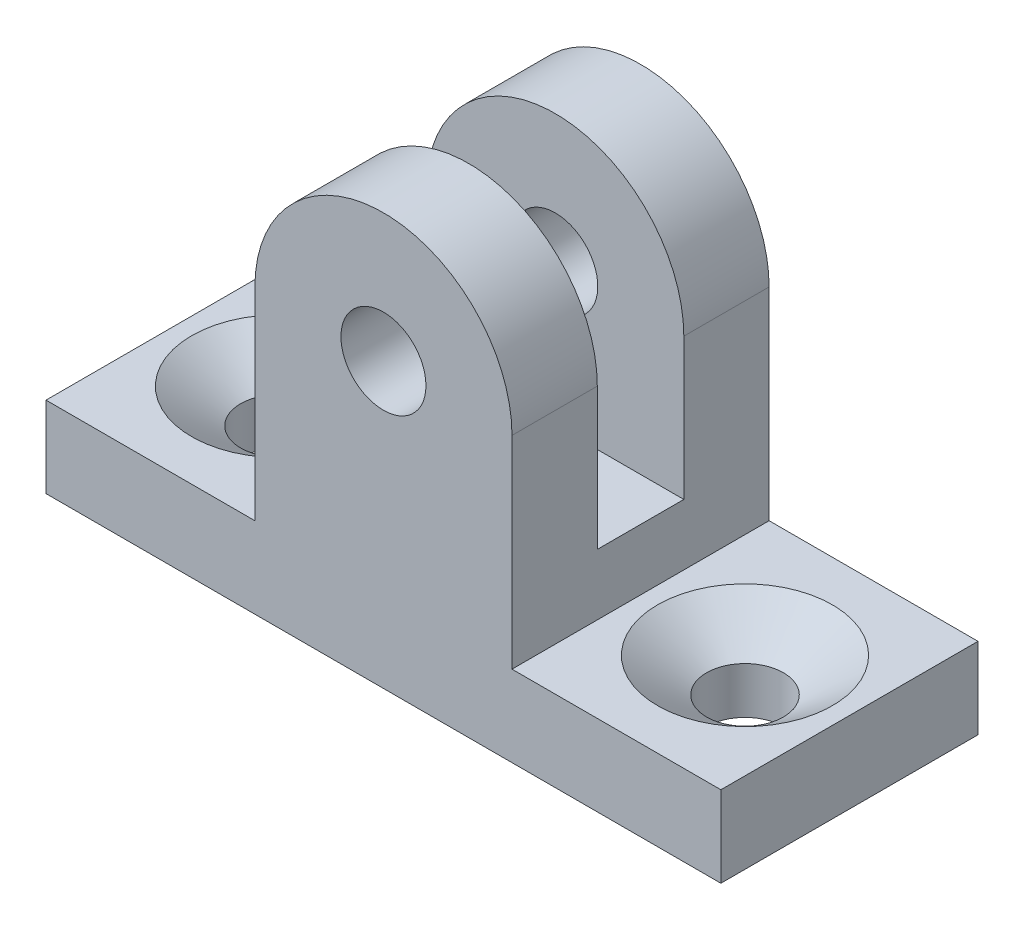
ISO-10303-21;
HEADER;
FILE_DESCRIPTION(('STEP AP214'),'2;1');
FILE_NAME('part.step','',(''),(''),'','','');
FILE_SCHEMA(('AUTOMOTIVE_DESIGN { 1 0 10303 214 1 1 1 1 }'));
ENDSEC;
DATA;
#1=APPLICATION_CONTEXT('core data for automotive mechanical design processes');
#2=APPLICATION_PROTOCOL_DEFINITION('international standard','automotive_design',2000,#1);
#3=PRODUCT_CONTEXT('',#1,'mechanical');
#4=PRODUCT('Part','Part','',(#3));
#5=PRODUCT_RELATED_PRODUCT_CATEGORY('part','',(#4));
#6=PRODUCT_DEFINITION_FORMATION('','',#4);
#7=PRODUCT_DEFINITION_CONTEXT('part definition',#1,'design');
#8=PRODUCT_DEFINITION('design','',#6,#7);
#9=PRODUCT_DEFINITION_SHAPE('','',#8);
#10=(LENGTH_UNIT() NAMED_UNIT(*) SI_UNIT(.MILLI.,.METRE.));
#11=(NAMED_UNIT(*) PLANE_ANGLE_UNIT() SI_UNIT($,.RADIAN.));
#12=(NAMED_UNIT(*) SI_UNIT($,.STERADIAN.) SOLID_ANGLE_UNIT());
#13=UNCERTAINTY_MEASURE_WITH_UNIT(LENGTH_MEASURE(1.E-05),#10,'distance_accuracy_value','');
#14=(GEOMETRIC_REPRESENTATION_CONTEXT(3) GLOBAL_UNCERTAINTY_ASSIGNED_CONTEXT((#13)) GLOBAL_UNIT_ASSIGNED_CONTEXT((#10,
#11,#12)) REPRESENTATION_CONTEXT('',''));
#15=CARTESIAN_POINT('',(0.,0.,0.));
#16=DIRECTION('',(0.,0.,1.));
#17=DIRECTION('',(1.,0.,0.));
#18=AXIS2_PLACEMENT_3D('',#15,#16,#17);
#19=CARTESIAN_POINT('',(0.,10.5,9.525));
#20=DIRECTION('',(0.,0.,-1.));
#21=DIRECTION('',(-1.,0.,0.));
#22=AXIS2_PLACEMENT_3D('',#19,#20,#21);
#23=CYLINDRICAL_SURFACE('',#22,4.7625);
#24=DIRECTION('',(0.,0.,-1.));
#25=VECTOR('',#24,1.);
#26=CARTESIAN_POINT('',(4.7625,10.5,9.525));
#27=LINE('',#26,#25);
#28=CARTESIAN_POINT('',(4.7625,10.5,9.525));
#29=VERTEX_POINT('',#28);
#30=CARTESIAN_POINT('',(4.7625,10.5,6.365));
#31=VERTEX_POINT('',#30);
#32=EDGE_CURVE('E41',#29,#31,#27,.T.);
#33=ORIENTED_EDGE('',*,*,#32,.T.);
#34=CARTESIAN_POINT('',(0.,10.5,6.365));
#35=DIRECTION('',(0.,0.,1.));
#36=DIRECTION('',(0.,-1.,0.));
#37=AXIS2_PLACEMENT_3D('',#34,#35,#36);
#38=CIRCLE('',#37,4.7625);
#39=CARTESIAN_POINT('',(-4.76249999999999,10.5,6.365));
#40=VERTEX_POINT('',#39);
#41=EDGE_CURVE('E181',#31,#40,#38,.T.);
#42=ORIENTED_EDGE('',*,*,#41,.T.);
#43=DIRECTION('',(0.,0.,-1.));
#44=VECTOR('',#43,1.);
#45=CARTESIAN_POINT('',(-4.7625,10.5,9.525));
#46=LINE('',#45,#44);
#47=CARTESIAN_POINT('',(-4.7625,10.5,9.525));
#48=VERTEX_POINT('',#47);
#49=EDGE_CURVE('E169',#48,#40,#46,.T.);
#50=ORIENTED_EDGE('',*,*,#49,.F.);
#51=CARTESIAN_POINT('',(0.,10.5,9.525));
#52=DIRECTION('',(0.,0.,1.));
#53=DIRECTION('',(-1.,0.,0.));
#54=AXIS2_PLACEMENT_3D('',#51,#52,#53);
#55=CIRCLE('',#54,4.7625);
#56=EDGE_CURVE('E232',#29,#48,#55,.T.);
#57=ORIENTED_EDGE('',*,*,#56,.F.);
#58=EDGE_LOOP('',(#33,#42,#50,#57));
#59=FACE_BOUND('',#58,.T.);
#60=ADVANCED_FACE('F32',(#59),#23,.T.);
#61=CARTESIAN_POINT('',(0.,10.5,9.525));
#62=DIRECTION('',(0.,0.,-1.));
#63=DIRECTION('',(-1.,0.,0.));
#64=AXIS2_PLACEMENT_3D('',#61,#62,#63);
#65=CYLINDRICAL_SURFACE('',#64,1.575);
#66=CARTESIAN_POINT('',(0.,10.5,6.365));
#67=DIRECTION('',(0.,0.,1.));
#68=DIRECTION('',(0.,-1.,0.));
#69=AXIS2_PLACEMENT_3D('',#66,#67,#68);
#70=CIRCLE('',#69,1.575);
#71=CARTESIAN_POINT('',(0.,8.925,6.365));
#72=VERTEX_POINT('',#71);
#73=EDGE_CURVE('E179',#72,#72,#70,.T.);
#74=ORIENTED_EDGE('',*,*,#73,.F.);
#75=EDGE_LOOP('',(#74));
#76=FACE_BOUND('',#75,.T.);
#77=CARTESIAN_POINT('',(0.,10.5,9.525));
#78=DIRECTION('',(0.,0.,1.));
#79=DIRECTION('',(1.,0.,0.));
#80=AXIS2_PLACEMENT_3D('',#77,#78,#79);
#81=CIRCLE('',#80,1.575);
#82=CARTESIAN_POINT('',(1.575,10.5,9.525));
#83=VERTEX_POINT('',#82);
#84=EDGE_CURVE('E147',#83,#83,#81,.T.);
#85=ORIENTED_EDGE('',*,*,#84,.T.);
#86=EDGE_LOOP('',(#85));
#87=FACE_BOUND('',#86,.T.);
#88=ADVANCED_FACE('F291',(#76,#87),#65,.F.);
#89=CARTESIAN_POINT('',(0.,10.5,9.525));
#90=DIRECTION('',(0.,0.,-1.));
#91=DIRECTION('',(-1.,0.,0.));
#92=AXIS2_PLACEMENT_3D('',#89,#90,#91);
#93=PLANE('',#92);
#94=DIRECTION('',(-1.,0.,0.));
#95=VECTOR('',#94,1.);
#96=CARTESIAN_POINT('',(4.7625,3.,9.525));
#97=LINE('',#96,#95);
#98=CARTESIAN_POINT('',(12.5,3.,9.525));
#99=VERTEX_POINT('',#98);
#100=CARTESIAN_POINT('',(4.7625,3.,9.525));
#101=VERTEX_POINT('',#100);
#102=EDGE_CURVE('E161',#99,#101,#97,.T.);
#103=ORIENTED_EDGE('',*,*,#102,.T.);
#104=DIRECTION('',(0.,1.,0.));
#105=VECTOR('',#104,1.);
#106=CARTESIAN_POINT('',(4.7625,10.5,9.525));
#107=LINE('',#106,#105);
#108=EDGE_CURVE('E99',#101,#29,#107,.T.);
#109=ORIENTED_EDGE('',*,*,#108,.T.);
#110=ORIENTED_EDGE('',*,*,#56,.T.);
#111=DIRECTION('',(0.,-1.,0.));
#112=VECTOR('',#111,1.);
#113=CARTESIAN_POINT('',(-4.7625,10.5,9.525));
#114=LINE('',#113,#112);
#115=CARTESIAN_POINT('',(-4.76249999999999,3.,9.525));
#116=VERTEX_POINT('',#115);
#117=EDGE_CURVE('E234',#48,#116,#114,.T.);
#118=ORIENTED_EDGE('',*,*,#117,.T.);
#119=DIRECTION('',(-1.,0.,0.));
#120=VECTOR('',#119,1.);
#121=CARTESIAN_POINT('',(-4.76249999999999,3.,9.525));
#122=LINE('',#121,#120);
#123=CARTESIAN_POINT('',(-12.5,3.,9.525));
#124=VERTEX_POINT('',#123);
#125=EDGE_CURVE('E122',#116,#124,#122,.T.);
#126=ORIENTED_EDGE('',*,*,#125,.T.);
#127=DIRECTION('',(0.,-1.,0.));
#128=VECTOR('',#127,1.);
#129=CARTESIAN_POINT('',(-12.5,3.,9.525));
#130=LINE('',#129,#128);
#131=CARTESIAN_POINT('',(-12.5,0.,9.525));
#132=VERTEX_POINT('',#131);
#133=EDGE_CURVE('E114',#124,#132,#130,.T.);
#134=ORIENTED_EDGE('',*,*,#133,.T.);
#135=DIRECTION('',(1.,0.,0.));
#136=VECTOR('',#135,1.);
#137=CARTESIAN_POINT('',(-12.5,0.,9.525));
#138=LINE('',#137,#136);
#139=CARTESIAN_POINT('',(12.5,0.,9.525));
#140=VERTEX_POINT('',#139);
#141=EDGE_CURVE('E119',#132,#140,#138,.T.);
#142=ORIENTED_EDGE('',*,*,#141,.T.);
#143=DIRECTION('',(0.,1.,0.));
#144=VECTOR('',#143,1.);
#145=CARTESIAN_POINT('',(12.5,3.,9.525));
#146=LINE('',#145,#144);
#147=EDGE_CURVE('E58',#140,#99,#146,.T.);
#148=ORIENTED_EDGE('',*,*,#147,.T.);
#149=EDGE_LOOP('',(#103,#109,#110,#118,#126,#134,#142,#148));
#150=FACE_BOUND('',#149,.T.);
#151=ORIENTED_EDGE('',*,*,#84,.F.);
#152=EDGE_LOOP('',(#151));
#153=FACE_BOUND('',#152,.T.);
#154=ADVANCED_FACE('F116',(#150,#153),#93,.F.);
#155=CARTESIAN_POINT('',(0.,10.5,0.));
#156=DIRECTION('',(0.,0.,-1.));
#157=DIRECTION('',(-1.,0.,0.));
#158=AXIS2_PLACEMENT_3D('',#155,#156,#157);
#159=PLANE('',#158);
#160=DIRECTION('',(-1.,0.,0.));
#161=VECTOR('',#160,1.);
#162=CARTESIAN_POINT('',(4.7625,3.,0.));
#163=LINE('',#162,#161);
#164=CARTESIAN_POINT('',(12.5,3.,0.));
#165=VERTEX_POINT('',#164);
#166=CARTESIAN_POINT('',(4.7625,3.,0.));
#167=VERTEX_POINT('',#166);
#168=EDGE_CURVE('E143',#165,#167,#163,.T.);
#169=ORIENTED_EDGE('',*,*,#168,.F.);
#170=DIRECTION('',(0.,1.,0.));
#171=VECTOR('',#170,1.);
#172=CARTESIAN_POINT('',(12.5,3.,0.));
#173=LINE('',#172,#171);
#174=CARTESIAN_POINT('',(12.5,0.,0.));
#175=VERTEX_POINT('',#174);
#176=EDGE_CURVE('E91',#175,#165,#173,.T.);
#177=ORIENTED_EDGE('',*,*,#176,.F.);
#178=DIRECTION('',(1.,0.,0.));
#179=VECTOR('',#178,1.);
#180=CARTESIAN_POINT('',(-12.5,0.,0.));
#181=LINE('',#180,#179);
#182=CARTESIAN_POINT('',(-12.5,0.,0.));
#183=VERTEX_POINT('',#182);
#184=EDGE_CURVE('E158',#183,#175,#181,.T.);
#185=ORIENTED_EDGE('',*,*,#184,.F.);
#186=DIRECTION('',(0.,-1.,0.));
#187=VECTOR('',#186,1.);
#188=CARTESIAN_POINT('',(-12.5,3.,0.));
#189=LINE('',#188,#187);
#190=CARTESIAN_POINT('',(-12.5,3.,0.));
#191=VERTEX_POINT('',#190);
#192=EDGE_CURVE('E131',#191,#183,#189,.T.);
#193=ORIENTED_EDGE('',*,*,#192,.F.);
#194=DIRECTION('',(-1.,0.,0.));
#195=VECTOR('',#194,1.);
#196=CARTESIAN_POINT('',(-4.76249999999999,3.,0.));
#197=LINE('',#196,#195);
#198=CARTESIAN_POINT('',(-4.76249999999999,3.,0.));
#199=VERTEX_POINT('',#198);
#200=EDGE_CURVE('E155',#199,#191,#197,.T.);
#201=ORIENTED_EDGE('',*,*,#200,.F.);
#202=DIRECTION('',(0.,-1.,0.));
#203=VECTOR('',#202,1.);
#204=CARTESIAN_POINT('',(-4.7625,10.5,0.));
#205=LINE('',#204,#203);
#206=CARTESIAN_POINT('',(-4.7625,10.5,0.));
#207=VERTEX_POINT('',#206);
#208=EDGE_CURVE('E153',#207,#199,#205,.T.);
#209=ORIENTED_EDGE('',*,*,#208,.F.);
#210=CARTESIAN_POINT('',(0.,10.5,0.));
#211=DIRECTION('',(0.,0.,1.));
#212=DIRECTION('',(-1.,0.,0.));
#213=AXIS2_PLACEMENT_3D('',#210,#211,#212);
#214=CIRCLE('',#213,4.7625);
#215=CARTESIAN_POINT('',(4.7625,10.5,0.));
#216=VERTEX_POINT('',#215);
#217=EDGE_CURVE('E150',#216,#207,#214,.T.);
#218=ORIENTED_EDGE('',*,*,#217,.F.);
#219=DIRECTION('',(0.,1.,0.));
#220=VECTOR('',#219,1.);
#221=CARTESIAN_POINT('',(4.7625,10.5,0.));
#222=LINE('',#221,#220);
#223=EDGE_CURVE('E146',#167,#216,#222,.T.);
#224=ORIENTED_EDGE('',*,*,#223,.F.);
#225=EDGE_LOOP('',(#169,#177,#185,#193,#201,#209,#218,#224));
#226=FACE_BOUND('',#225,.T.);
#227=CARTESIAN_POINT('',(0.,10.5,0.));
#228=DIRECTION('',(0.,0.,1.));
#229=DIRECTION('',(1.,0.,0.));
#230=AXIS2_PLACEMENT_3D('',#227,#228,#229);
#231=CIRCLE('',#230,1.575);
#232=CARTESIAN_POINT('',(1.575,10.5,0.));
#233=VERTEX_POINT('',#232);
#234=EDGE_CURVE('E225',#233,#233,#231,.T.);
#235=ORIENTED_EDGE('',*,*,#234,.T.);
#236=EDGE_LOOP('',(#235));
#237=FACE_BOUND('',#236,.T.);
#238=ADVANCED_FACE('F247',(#226,#237),#159,.T.);
#239=CARTESIAN_POINT('',(4.7625,3.,9.525));
#240=DIRECTION('',(0.,-1.,0.));
#241=DIRECTION('',(1.,0.,0.));
#242=AXIS2_PLACEMENT_3D('',#239,#240,#241);
#243=PLANE('',#242);
#244=CARTESIAN_POINT('',(8.63125,3.,4.7625));
#245=DIRECTION('',(0.,1.,0.));
#246=DIRECTION('',(-1.,0.,0.));
#247=AXIS2_PLACEMENT_3D('',#244,#245,#246);
#248=CIRCLE('',#247,3.2385);
#249=CARTESIAN_POINT('',(5.39275,3.,4.7625));
#250=VERTEX_POINT('',#249);
#251=EDGE_CURVE('E185',#250,#250,#248,.T.);
#252=ORIENTED_EDGE('',*,*,#251,.F.);
#253=EDGE_LOOP('',(#252));
#254=FACE_BOUND('',#253,.T.);
#255=ORIENTED_EDGE('',*,*,#168,.T.);
#256=DIRECTION('',(0.,0.,-1.));
#257=VECTOR('',#256,1.);
#258=CARTESIAN_POINT('',(4.7625,3.,9.525));
#259=LINE('',#258,#257);
#260=EDGE_CURVE('E11',#101,#167,#259,.T.);
#261=ORIENTED_EDGE('',*,*,#260,.F.);
#262=ORIENTED_EDGE('',*,*,#102,.F.);
#263=DIRECTION('',(0.,0.,-1.));
#264=VECTOR('',#263,1.);
#265=CARTESIAN_POINT('',(12.5,3.,9.525));
#266=LINE('',#265,#264);
#267=EDGE_CURVE('E139',#99,#165,#266,.T.);
#268=ORIENTED_EDGE('',*,*,#267,.T.);
#269=EDGE_LOOP('',(#255,#261,#262,#268));
#270=FACE_BOUND('',#269,.T.);
#271=ADVANCED_FACE('F34',(#254,#270),#243,.F.);
#272=CARTESIAN_POINT('',(4.7625,10.5,9.525));
#273=DIRECTION('',(-1.,0.,0.));
#274=DIRECTION('',(0.,-1.,0.));
#275=AXIS2_PLACEMENT_3D('',#272,#273,#274);
#276=PLANE('',#275);
#277=DIRECTION('',(0.,0.,-1.));
#278=VECTOR('',#277,1.);
#279=CARTESIAN_POINT('',(4.7625,5.2625,6.365));
#280=LINE('',#279,#278);
#281=CARTESIAN_POINT('',(4.7625,5.2625,6.365));
#282=VERTEX_POINT('',#281);
#283=CARTESIAN_POINT('',(4.7625,5.2625,3.16));
#284=VERTEX_POINT('',#283);
#285=EDGE_CURVE('E202',#282,#284,#280,.T.);
#286=ORIENTED_EDGE('',*,*,#285,.F.);
#287=DIRECTION('',(0.,-1.,0.));
#288=VECTOR('',#287,1.);
#289=CARTESIAN_POINT('',(4.7625,15.2625,6.365));
#290=LINE('',#289,#288);
#291=EDGE_CURVE('E205',#31,#282,#290,.T.);
#292=ORIENTED_EDGE('',*,*,#291,.F.);
#293=ORIENTED_EDGE('',*,*,#32,.F.);
#294=ORIENTED_EDGE('',*,*,#108,.F.);
#295=ORIENTED_EDGE('',*,*,#260,.T.);
#296=ORIENTED_EDGE('',*,*,#223,.T.);
#297=CARTESIAN_POINT('',(4.7625,10.5,3.16));
#298=VERTEX_POINT('',#297);
#299=EDGE_CURVE('E172',#298,#216,#27,.T.);
#300=ORIENTED_EDGE('',*,*,#299,.F.);
#301=DIRECTION('',(0.,1.,0.));
#302=VECTOR('',#301,1.);
#303=CARTESIAN_POINT('',(4.7625,5.2625,3.16));
#304=LINE('',#303,#302);
#305=EDGE_CURVE('E178',#284,#298,#304,.T.);
#306=ORIENTED_EDGE('',*,*,#305,.F.);
#307=EDGE_LOOP('',(#286,#292,#293,#294,#295,#296,#300,#306));
#308=FACE_BOUND('',#307,.T.);
#309=ADVANCED_FACE('F255',(#308),#276,.F.);
#310=CARTESIAN_POINT('',(0.,10.5,3.16));
#311=DIRECTION('',(0.,0.,-1.));
#312=DIRECTION('',(0.,1.,0.));
#313=AXIS2_PLACEMENT_3D('',#310,#311,#312);
#314=CIRCLE('',#313,4.7625);
#315=CARTESIAN_POINT('',(-4.7625,10.5,3.16));
#316=VERTEX_POINT('',#315);
#317=EDGE_CURVE('E49',#316,#298,#314,.T.);
#318=ORIENTED_EDGE('',*,*,#317,.T.);
#319=ORIENTED_EDGE('',*,*,#299,.T.);
#320=ORIENTED_EDGE('',*,*,#217,.T.);
#321=EDGE_CURVE('E168',#316,#207,#46,.T.);
#322=ORIENTED_EDGE('',*,*,#321,.F.);
#323=EDGE_LOOP('',(#318,#319,#320,#322));
#324=FACE_BOUND('',#323,.T.);
#325=ADVANCED_FACE('F282',(#324),#23,.T.);
#326=CARTESIAN_POINT('',(-4.7625,10.5,9.525));
#327=DIRECTION('',(1.,0.,0.));
#328=DIRECTION('',(0.,1.,0.));
#329=AXIS2_PLACEMENT_3D('',#326,#327,#328);
#330=PLANE('',#329);
#331=ORIENTED_EDGE('',*,*,#49,.T.);
#332=DIRECTION('',(0.,1.,0.));
#333=VECTOR('',#332,1.);
#334=CARTESIAN_POINT('',(-4.76249999999999,15.2625,6.365));
#335=LINE('',#334,#333);
#336=CARTESIAN_POINT('',(-4.76249999999999,5.2625,6.365));
#337=VERTEX_POINT('',#336);
#338=EDGE_CURVE('E213',#337,#40,#335,.T.);
#339=ORIENTED_EDGE('',*,*,#338,.F.);
#340=DIRECTION('',(0.,0.,1.));
#341=VECTOR('',#340,1.);
#342=CARTESIAN_POINT('',(-4.76249999999999,5.2625,6.365));
#343=LINE('',#342,#341);
#344=CARTESIAN_POINT('',(-4.76249999999999,5.2625,3.16));
#345=VERTEX_POINT('',#344);
#346=EDGE_CURVE('E210',#345,#337,#343,.T.);
#347=ORIENTED_EDGE('',*,*,#346,.F.);
#348=DIRECTION('',(0.,-1.,0.));
#349=VECTOR('',#348,1.);
#350=CARTESIAN_POINT('',(-4.76249999999999,5.2625,3.16));
#351=LINE('',#350,#349);
#352=EDGE_CURVE('E201',#316,#345,#351,.T.);
#353=ORIENTED_EDGE('',*,*,#352,.F.);
#354=ORIENTED_EDGE('',*,*,#321,.T.);
#355=ORIENTED_EDGE('',*,*,#208,.T.);
#356=DIRECTION('',(0.,0.,-1.));
#357=VECTOR('',#356,1.);
#358=CARTESIAN_POINT('',(-4.76249999999999,3.,9.525));
#359=LINE('',#358,#357);
#360=EDGE_CURVE('E165',#116,#199,#359,.T.);
#361=ORIENTED_EDGE('',*,*,#360,.F.);
#362=ORIENTED_EDGE('',*,*,#117,.F.);
#363=EDGE_LOOP('',(#331,#339,#347,#353,#354,#355,#361,#362));
#364=FACE_BOUND('',#363,.T.);
#365=ADVANCED_FACE('F240',(#364),#330,.F.);
#366=CARTESIAN_POINT('',(-4.76249999999999,3.,9.525));
#367=DIRECTION('',(0.,-1.,0.));
#368=DIRECTION('',(1.,0.,0.));
#369=AXIS2_PLACEMENT_3D('',#366,#367,#368);
#370=PLANE('',#369);
#371=CARTESIAN_POINT('',(-8.63125,3.,4.76250000000001));
#372=DIRECTION('',(0.,1.,0.));
#373=DIRECTION('',(-1.,0.,0.));
#374=AXIS2_PLACEMENT_3D('',#371,#372,#373);
#375=CIRCLE('',#374,3.2385);
#376=CARTESIAN_POINT('',(-11.86975,3.,4.76250000000001));
#377=VERTEX_POINT('',#376);
#378=EDGE_CURVE('E196',#377,#377,#375,.T.);
#379=ORIENTED_EDGE('',*,*,#378,.F.);
#380=EDGE_LOOP('',(#379));
#381=FACE_BOUND('',#380,.T.);
#382=ORIENTED_EDGE('',*,*,#200,.T.);
#383=DIRECTION('',(0.,0.,-1.));
#384=VECTOR('',#383,1.);
#385=CARTESIAN_POINT('',(-12.5,3.,9.525));
#386=LINE('',#385,#384);
#387=EDGE_CURVE('E134',#124,#191,#386,.T.);
#388=ORIENTED_EDGE('',*,*,#387,.F.);
#389=ORIENTED_EDGE('',*,*,#125,.F.);
#390=ORIENTED_EDGE('',*,*,#360,.T.);
#391=EDGE_LOOP('',(#382,#388,#389,#390));
#392=FACE_BOUND('',#391,.T.);
#393=ADVANCED_FACE('F244',(#381,#392),#370,.F.);
#394=CARTESIAN_POINT('',(-12.5,3.,9.525));
#395=DIRECTION('',(1.,0.,0.));
#396=DIRECTION('',(0.,0.,-1.));
#397=AXIS2_PLACEMENT_3D('',#394,#395,#396);
#398=PLANE('',#397);
#399=ORIENTED_EDGE('',*,*,#192,.T.);
#400=DIRECTION('',(0.,0.,-1.));
#401=VECTOR('',#400,1.);
#402=CARTESIAN_POINT('',(-12.5,0.,9.525));
#403=LINE('',#402,#401);
#404=EDGE_CURVE('E128',#132,#183,#403,.T.);
#405=ORIENTED_EDGE('',*,*,#404,.F.);
#406=ORIENTED_EDGE('',*,*,#133,.F.);
#407=ORIENTED_EDGE('',*,*,#387,.T.);
#408=EDGE_LOOP('',(#399,#405,#406,#407));
#409=FACE_BOUND('',#408,.T.);
#410=ADVANCED_FACE('F129',(#409),#398,.F.);
#411=CARTESIAN_POINT('',(-12.5,0.,9.525));
#412=DIRECTION('',(0.,1.,0.));
#413=DIRECTION('',(-1.,0.,0.));
#414=AXIS2_PLACEMENT_3D('',#411,#412,#413);
#415=PLANE('',#414);
#416=CARTESIAN_POINT('',(-8.63125,0.,4.76250000000001));
#417=DIRECTION('',(0.,1.,0.));
#418=DIRECTION('',(-1.,0.,0.));
#419=AXIS2_PLACEMENT_3D('',#416,#417,#418);
#420=CIRCLE('',#419,1.4224);
#421=CARTESIAN_POINT('',(-10.05365,0.,4.76250000000001));
#422=VERTEX_POINT('',#421);
#423=EDGE_CURVE('E184',#422,#422,#420,.F.);
#424=ORIENTED_EDGE('',*,*,#423,.F.);
#425=EDGE_LOOP('',(#424));
#426=FACE_BOUND('',#425,.T.);
#427=CARTESIAN_POINT('',(8.63125,0.,4.7625));
#428=DIRECTION('',(0.,1.,0.));
#429=DIRECTION('',(-1.,0.,0.));
#430=AXIS2_PLACEMENT_3D('',#427,#428,#429);
#431=CIRCLE('',#430,1.4224);
#432=CARTESIAN_POINT('',(7.20885,0.,4.7625));
#433=VERTEX_POINT('',#432);
#434=EDGE_CURVE('E189',#433,#433,#431,.F.);
#435=ORIENTED_EDGE('',*,*,#434,.F.);
#436=EDGE_LOOP('',(#435));
#437=FACE_BOUND('',#436,.T.);
#438=ORIENTED_EDGE('',*,*,#184,.T.);
#439=DIRECTION('',(0.,0.,-1.));
#440=VECTOR('',#439,1.);
#441=CARTESIAN_POINT('',(12.5,0.,9.525));
#442=LINE('',#441,#440);
#443=EDGE_CURVE('E135',#140,#175,#442,.T.);
#444=ORIENTED_EDGE('',*,*,#443,.F.);
#445=ORIENTED_EDGE('',*,*,#141,.F.);
#446=ORIENTED_EDGE('',*,*,#404,.T.);
#447=EDGE_LOOP('',(#438,#444,#445,#446));
#448=FACE_BOUND('',#447,.T.);
#449=ADVANCED_FACE('F137',(#426,#437,#448),#415,.F.);
#450=CARTESIAN_POINT('',(12.5,3.,9.525));
#451=DIRECTION('',(-1.,0.,0.));
#452=DIRECTION('',(0.,-1.,0.));
#453=AXIS2_PLACEMENT_3D('',#450,#451,#452);
#454=PLANE('',#453);
#455=ORIENTED_EDGE('',*,*,#176,.T.);
#456=ORIENTED_EDGE('',*,*,#267,.F.);
#457=ORIENTED_EDGE('',*,*,#147,.F.);
#458=ORIENTED_EDGE('',*,*,#443,.T.);
#459=EDGE_LOOP('',(#455,#456,#457,#458));
#460=FACE_BOUND('',#459,.T.);
#461=ADVANCED_FACE('F249',(#460),#454,.F.);
#462=CARTESIAN_POINT('',(0.,10.5,3.16));
#463=DIRECTION('',(0.,0.,-1.));
#464=DIRECTION('',(0.,1.,0.));
#465=AXIS2_PLACEMENT_3D('',#462,#463,#464);
#466=CIRCLE('',#465,1.575);
#467=CARTESIAN_POINT('',(0.,12.075,3.16));
#468=VERTEX_POINT('',#467);
#469=EDGE_CURVE('E175',#468,#468,#466,.T.);
#470=ORIENTED_EDGE('',*,*,#469,.F.);
#471=EDGE_LOOP('',(#470));
#472=FACE_BOUND('',#471,.T.);
#473=ORIENTED_EDGE('',*,*,#234,.F.);
#474=EDGE_LOOP('',(#473));
#475=FACE_BOUND('',#474,.T.);
#476=ADVANCED_FACE('F297',(#472,#475),#65,.F.);
#477=CARTESIAN_POINT('',(15.263548757148,15.2625,6.365));
#478=DIRECTION('',(0.,0.,1.));
#479=DIRECTION('',(0.,-1.,0.));
#480=AXIS2_PLACEMENT_3D('',#477,#478,#479);
#481=PLANE('',#480);
#482=ORIENTED_EDGE('',*,*,#73,.T.);
#483=EDGE_LOOP('',(#482));
#484=FACE_BOUND('',#483,.T.);
#485=ORIENTED_EDGE('',*,*,#291,.T.);
#486=DIRECTION('',(-1.,0.,0.));
#487=VECTOR('',#486,1.);
#488=CARTESIAN_POINT('',(15.263548757148,5.2625,6.365));
#489=LINE('',#488,#487);
#490=EDGE_CURVE('E206',#282,#337,#489,.T.);
#491=ORIENTED_EDGE('',*,*,#490,.T.);
#492=ORIENTED_EDGE('',*,*,#338,.T.);
#493=ORIENTED_EDGE('',*,*,#41,.F.);
#494=EDGE_LOOP('',(#485,#491,#492,#493));
#495=FACE_BOUND('',#494,.T.);
#496=ADVANCED_FACE('F306',(#484,#495),#481,.F.);
#497=CARTESIAN_POINT('',(15.263548757148,5.2625,3.16));
#498=DIRECTION('',(0.,0.,-1.));
#499=DIRECTION('',(0.,1.,0.));
#500=AXIS2_PLACEMENT_3D('',#497,#498,#499);
#501=PLANE('',#500);
#502=ORIENTED_EDGE('',*,*,#469,.T.);
#503=EDGE_LOOP('',(#502));
#504=FACE_BOUND('',#503,.T.);
#505=ORIENTED_EDGE('',*,*,#317,.F.);
#506=ORIENTED_EDGE('',*,*,#352,.T.);
#507=DIRECTION('',(-1.,0.,0.));
#508=VECTOR('',#507,1.);
#509=CARTESIAN_POINT('',(15.263548757148,5.2625,3.16));
#510=LINE('',#509,#508);
#511=EDGE_CURVE('E216',#284,#345,#510,.T.);
#512=ORIENTED_EDGE('',*,*,#511,.F.);
#513=ORIENTED_EDGE('',*,*,#305,.T.);
#514=EDGE_LOOP('',(#505,#506,#512,#513));
#515=FACE_BOUND('',#514,.T.);
#516=ADVANCED_FACE('F273',(#504,#515),#501,.F.);
#517=CARTESIAN_POINT('',(15.263548757148,5.2625,6.365));
#518=DIRECTION('',(0.,-1.,0.));
#519=DIRECTION('',(1.,0.,0.));
#520=AXIS2_PLACEMENT_3D('',#517,#518,#519);
#521=PLANE('',#520);
#522=ORIENTED_EDGE('',*,*,#285,.T.);
#523=ORIENTED_EDGE('',*,*,#511,.T.);
#524=ORIENTED_EDGE('',*,*,#346,.T.);
#525=ORIENTED_EDGE('',*,*,#490,.F.);
#526=EDGE_LOOP('',(#522,#523,#524,#525));
#527=FACE_BOUND('',#526,.T.);
#528=ADVANCED_FACE('F277',(#527),#521,.F.);
#529=CARTESIAN_POINT('',(8.63125,-4.02315474223899,4.7625));
#530=DIRECTION('',(0.,1.,0.));
#531=DIRECTION('',(-1.,0.,0.));
#532=AXIS2_PLACEMENT_3D('',#529,#530,#531);
#533=CYLINDRICAL_SURFACE('',#532,1.4224);
#534=CARTESIAN_POINT('',(8.63125,1.72835308985735,4.7625));
#535=DIRECTION('',(0.,1.,0.));
#536=DIRECTION('',(-1.,0.,0.));
#537=AXIS2_PLACEMENT_3D('',#534,#535,#536);
#538=CIRCLE('',#537,1.4224);
#539=CARTESIAN_POINT('',(7.20885,1.72835308985735,4.7625));
#540=VERTEX_POINT('',#539);
#541=EDGE_CURVE('E182',#540,#540,#538,.T.);
#542=ORIENTED_EDGE('',*,*,#541,.T.);
#543=EDGE_LOOP('',(#542));
#544=FACE_BOUND('',#543,.T.);
#545=ORIENTED_EDGE('',*,*,#434,.T.);
#546=EDGE_LOOP('',(#545));
#547=FACE_BOUND('',#546,.T.);
#548=ADVANCED_FACE('F347',(#544,#547),#533,.F.);
#549=CARTESIAN_POINT('',(-8.63125,-4.02315474223898,4.76250000000001));
#550=DIRECTION('',(0.,1.,0.));
#551=DIRECTION('',(-1.,0.,0.));
#552=AXIS2_PLACEMENT_3D('',#549,#550,#551);
#553=CYLINDRICAL_SURFACE('',#552,1.4224);
#554=CARTESIAN_POINT('',(-8.63125,1.72835308985735,4.76250000000001));
#555=DIRECTION('',(0.,1.,0.));
#556=DIRECTION('',(-1.,0.,0.));
#557=AXIS2_PLACEMENT_3D('',#554,#555,#556);
#558=CIRCLE('',#557,1.4224);
#559=CARTESIAN_POINT('',(-10.05365,1.72835308985735,4.76250000000001));
#560=VERTEX_POINT('',#559);
#561=EDGE_CURVE('E36',#560,#560,#558,.T.);
#562=ORIENTED_EDGE('',*,*,#561,.T.);
#563=EDGE_LOOP('',(#562));
#564=FACE_BOUND('',#563,.T.);
#565=ORIENTED_EDGE('',*,*,#423,.T.);
#566=EDGE_LOOP('',(#565));
#567=FACE_BOUND('',#566,.T.);
#568=ADVANCED_FACE('F344',(#564,#567),#553,.F.);
#569=CARTESIAN_POINT('',(8.63125,3.,4.7625));
#570=DIRECTION('',(0.,1.,0.));
#571=DIRECTION('',(-1.,0.,0.));
#572=AXIS2_PLACEMENT_3D('',#569,#570,#571);
#573=CONICAL_SURFACE('',#572,3.2385,0.959931088596883);
#574=ORIENTED_EDGE('',*,*,#251,.T.);
#575=EDGE_LOOP('',(#574));
#576=FACE_BOUND('',#575,.T.);
#577=ORIENTED_EDGE('',*,*,#541,.F.);
#578=EDGE_LOOP('',(#577));
#579=FACE_BOUND('',#578,.T.);
#580=ADVANCED_FACE('F340',(#576,#579),#573,.F.);
#581=CARTESIAN_POINT('',(-8.63125,3.,4.76250000000001));
#582=DIRECTION('',(0.,1.,0.));
#583=DIRECTION('',(-1.,0.,0.));
#584=AXIS2_PLACEMENT_3D('',#581,#582,#583);
#585=CONICAL_SURFACE('',#584,3.2385,0.959931088596883);
#586=ORIENTED_EDGE('',*,*,#378,.T.);
#587=EDGE_LOOP('',(#586));
#588=FACE_BOUND('',#587,.T.);
#589=ORIENTED_EDGE('',*,*,#561,.F.);
#590=EDGE_LOOP('',(#589));
#591=FACE_BOUND('',#590,.T.);
#592=ADVANCED_FACE('F337',(#588,#591),#585,.F.);
#593=CLOSED_SHELL('',(#60,#88,#154,#238,#271,#309,#325,#365,#393,#410,#449,#461,#476,#496,#516,
#528,#548,#568,#580,#592));
#594=MANIFOLD_SOLID_BREP('B2',#593);
#595=ADVANCED_BREP_SHAPE_REPRESENTATION('',(#18,#594),#14);
#596=SHAPE_DEFINITION_REPRESENTATION(#9,#595);
ENDSEC;
END-ISO-10303-21;
